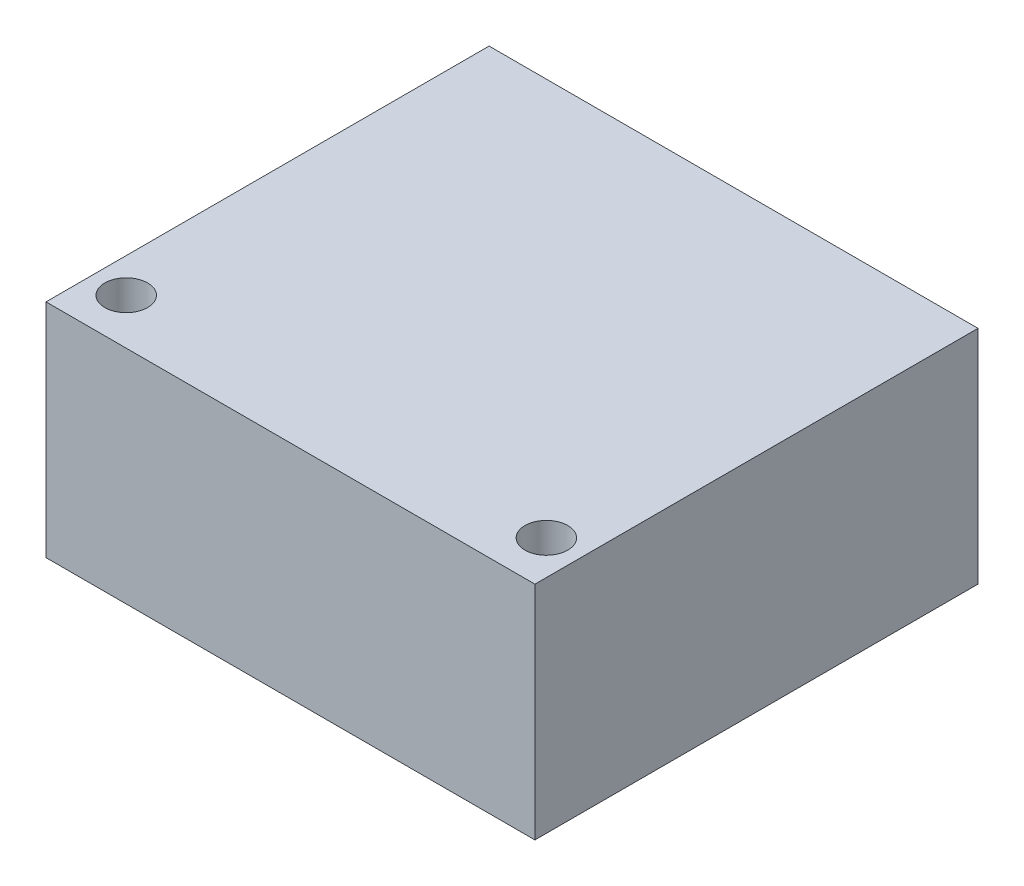
ISO-10303-21;
HEADER;
FILE_DESCRIPTION(('STEP AP214'),'2;1');
FILE_NAME('part.step','',(''),(''),'','','');
FILE_SCHEMA(('AUTOMOTIVE_DESIGN { 1 0 10303 214 1 1 1 1 }'));
ENDSEC;
DATA;
#1=APPLICATION_CONTEXT('core data for automotive mechanical design processes');
#2=APPLICATION_PROTOCOL_DEFINITION('international standard','automotive_design',2000,#1);
#3=PRODUCT_CONTEXT('',#1,'mechanical');
#4=PRODUCT('Part','Part','',(#3));
#5=PRODUCT_RELATED_PRODUCT_CATEGORY('part','',(#4));
#6=PRODUCT_DEFINITION_FORMATION('','',#4);
#7=PRODUCT_DEFINITION_CONTEXT('part definition',#1,'design');
#8=PRODUCT_DEFINITION('design','',#6,#7);
#9=PRODUCT_DEFINITION_SHAPE('','',#8);
#10=(LENGTH_UNIT() NAMED_UNIT(*) SI_UNIT(.MILLI.,.METRE.));
#11=(NAMED_UNIT(*) PLANE_ANGLE_UNIT() SI_UNIT($,.RADIAN.));
#12=(NAMED_UNIT(*) SI_UNIT($,.STERADIAN.) SOLID_ANGLE_UNIT());
#13=UNCERTAINTY_MEASURE_WITH_UNIT(LENGTH_MEASURE(1.E-05),#10,'distance_accuracy_value','');
#14=(GEOMETRIC_REPRESENTATION_CONTEXT(3) GLOBAL_UNCERTAINTY_ASSIGNED_CONTEXT((#13)) GLOBAL_UNIT_ASSIGNED_CONTEXT((#10,
#11,#12)) REPRESENTATION_CONTEXT('',''));
#15=CARTESIAN_POINT('',(0.,0.,0.));
#16=DIRECTION('',(0.,0.,1.));
#17=DIRECTION('',(1.,0.,0.));
#18=AXIS2_PLACEMENT_3D('',#15,#16,#17);
#19=CARTESIAN_POINT('',(16.,14.5,-14.5));
#20=DIRECTION('',(-1.,0.,0.));
#21=DIRECTION('',(0.,0.,1.));
#22=AXIS2_PLACEMENT_3D('',#19,#20,#21);
#23=PLANE('',#22);
#24=DIRECTION('',(0.,0.,-1.));
#25=VECTOR('',#24,1.);
#26=CARTESIAN_POINT('',(16.,0.,-14.5));
#27=LINE('',#26,#25);
#28=CARTESIAN_POINT('',(16.,0.,14.5));
#29=VERTEX_POINT('',#28);
#30=CARTESIAN_POINT('',(16.,0.,-14.5));
#31=VERTEX_POINT('',#30);
#32=EDGE_CURVE('E106',#29,#31,#27,.T.);
#33=ORIENTED_EDGE('',*,*,#32,.T.);
#34=DIRECTION('',(0.,-1.,0.));
#35=VECTOR('',#34,1.);
#36=CARTESIAN_POINT('',(16.,14.5,-14.5));
#37=LINE('',#36,#35);
#38=CARTESIAN_POINT('',(16.,14.5,-14.5));
#39=VERTEX_POINT('',#38);
#40=EDGE_CURVE('E11',#39,#31,#37,.T.);
#41=ORIENTED_EDGE('',*,*,#40,.F.);
#42=DIRECTION('',(0.,0.,-1.));
#43=VECTOR('',#42,1.);
#44=CARTESIAN_POINT('',(16.,14.5,-14.5));
#45=LINE('',#44,#43);
#46=CARTESIAN_POINT('',(16.,14.5,14.5));
#47=VERTEX_POINT('',#46);
#48=EDGE_CURVE('E90',#47,#39,#45,.T.);
#49=ORIENTED_EDGE('',*,*,#48,.F.);
#50=DIRECTION('',(0.,-1.,0.));
#51=VECTOR('',#50,1.);
#52=CARTESIAN_POINT('',(16.,14.5,14.5));
#53=LINE('',#52,#51);
#54=EDGE_CURVE('E102',#47,#29,#53,.T.);
#55=ORIENTED_EDGE('',*,*,#54,.T.);
#56=EDGE_LOOP('',(#33,#41,#49,#55));
#57=FACE_BOUND('',#56,.T.);
#58=ADVANCED_FACE('F38',(#57),#23,.F.);
#59=CARTESIAN_POINT('',(-16.,14.5,-14.5));
#60=DIRECTION('',(0.,0.,1.));
#61=DIRECTION('',(1.,0.,0.));
#62=AXIS2_PLACEMENT_3D('',#59,#60,#61);
#63=PLANE('',#62);
#64=DIRECTION('',(-1.,0.,0.));
#65=VECTOR('',#64,1.);
#66=CARTESIAN_POINT('',(-16.,0.,-14.5));
#67=LINE('',#66,#65);
#68=CARTESIAN_POINT('',(-16.,0.,-14.5));
#69=VERTEX_POINT('',#68);
#70=EDGE_CURVE('E95',#31,#69,#67,.T.);
#71=ORIENTED_EDGE('',*,*,#70,.T.);
#72=DIRECTION('',(0.,-1.,0.));
#73=VECTOR('',#72,1.);
#74=CARTESIAN_POINT('',(-16.,14.5,-14.5));
#75=LINE('',#74,#73);
#76=CARTESIAN_POINT('',(-16.,14.5,-14.5));
#77=VERTEX_POINT('',#76);
#78=EDGE_CURVE('E47',#77,#69,#75,.T.);
#79=ORIENTED_EDGE('',*,*,#78,.F.);
#80=DIRECTION('',(-1.,0.,0.));
#81=VECTOR('',#80,1.);
#82=CARTESIAN_POINT('',(-16.,14.5,-14.5));
#83=LINE('',#82,#81);
#84=EDGE_CURVE('E85',#39,#77,#83,.T.);
#85=ORIENTED_EDGE('',*,*,#84,.F.);
#86=ORIENTED_EDGE('',*,*,#40,.T.);
#87=EDGE_LOOP('',(#71,#79,#85,#86));
#88=FACE_BOUND('',#87,.T.);
#89=ADVANCED_FACE('F94',(#88),#63,.F.);
#90=CARTESIAN_POINT('',(-16.,14.5,-14.5));
#91=DIRECTION('',(1.,0.,0.));
#92=DIRECTION('',(0.,0.,-1.));
#93=AXIS2_PLACEMENT_3D('',#90,#91,#92);
#94=PLANE('',#93);
#95=DIRECTION('',(0.,0.,1.));
#96=VECTOR('',#95,1.);
#97=CARTESIAN_POINT('',(-16.,0.,-14.5));
#98=LINE('',#97,#96);
#99=CARTESIAN_POINT('',(-16.,0.,14.5));
#100=VERTEX_POINT('',#99);
#101=EDGE_CURVE('E72',#69,#100,#98,.T.);
#102=ORIENTED_EDGE('',*,*,#101,.T.);
#103=DIRECTION('',(0.,-1.,0.));
#104=VECTOR('',#103,1.);
#105=CARTESIAN_POINT('',(-16.,14.5,14.5));
#106=LINE('',#105,#104);
#107=CARTESIAN_POINT('',(-16.,14.5,14.5));
#108=VERTEX_POINT('',#107);
#109=EDGE_CURVE('E97',#108,#100,#106,.T.);
#110=ORIENTED_EDGE('',*,*,#109,.F.);
#111=DIRECTION('',(0.,0.,1.));
#112=VECTOR('',#111,1.);
#113=CARTESIAN_POINT('',(-16.,14.5,-14.5));
#114=LINE('',#113,#112);
#115=EDGE_CURVE('E88',#77,#108,#114,.T.);
#116=ORIENTED_EDGE('',*,*,#115,.F.);
#117=ORIENTED_EDGE('',*,*,#78,.T.);
#118=EDGE_LOOP('',(#102,#110,#116,#117));
#119=FACE_BOUND('',#118,.T.);
#120=ADVANCED_FACE('F98',(#119),#94,.F.);
#121=CARTESIAN_POINT('',(-16.,14.5,14.5));
#122=DIRECTION('',(0.,0.,-1.));
#123=DIRECTION('',(-1.,0.,0.));
#124=AXIS2_PLACEMENT_3D('',#121,#122,#123);
#125=PLANE('',#124);
#126=DIRECTION('',(1.,0.,0.));
#127=VECTOR('',#126,1.);
#128=CARTESIAN_POINT('',(-16.,0.,14.5));
#129=LINE('',#128,#127);
#130=EDGE_CURVE('E78',#100,#29,#129,.T.);
#131=ORIENTED_EDGE('',*,*,#130,.T.);
#132=ORIENTED_EDGE('',*,*,#54,.F.);
#133=DIRECTION('',(1.,0.,0.));
#134=VECTOR('',#133,1.);
#135=CARTESIAN_POINT('',(-16.,14.5,14.5));
#136=LINE('',#135,#134);
#137=EDGE_CURVE('E55',#108,#47,#136,.T.);
#138=ORIENTED_EDGE('',*,*,#137,.F.);
#139=ORIENTED_EDGE('',*,*,#109,.T.);
#140=EDGE_LOOP('',(#131,#132,#138,#139));
#141=FACE_BOUND('',#140,.T.);
#142=ADVANCED_FACE('F120',(#141),#125,.F.);
#143=CARTESIAN_POINT('',(0.,14.5,0.));
#144=DIRECTION('',(0.,1.,0.));
#145=DIRECTION('',(0.,0.,1.));
#146=AXIS2_PLACEMENT_3D('',#143,#144,#145);
#147=PLANE('',#146);
#148=CARTESIAN_POINT('',(-13.75,14.5,11.5));
#149=DIRECTION('',(0.,1.,0.));
#150=DIRECTION('',(0.,0.,1.));
#151=AXIS2_PLACEMENT_3D('',#148,#149,#150);
#152=CIRCLE('',#151,1.4);
#153=CARTESIAN_POINT('',(-13.75,14.5,12.9));
#154=VERTEX_POINT('',#153);
#155=EDGE_CURVE('E135',#154,#154,#152,.T.);
#156=ORIENTED_EDGE('',*,*,#155,.F.);
#157=EDGE_LOOP('',(#156));
#158=FACE_BOUND('',#157,.T.);
#159=CARTESIAN_POINT('',(13.75,14.5,11.5));
#160=DIRECTION('',(0.,1.,0.));
#161=DIRECTION('',(0.,0.,1.));
#162=AXIS2_PLACEMENT_3D('',#159,#160,#161);
#163=CIRCLE('',#162,1.4);
#164=CARTESIAN_POINT('',(13.75,14.5,12.9));
#165=VERTEX_POINT('',#164);
#166=EDGE_CURVE('E127',#165,#165,#163,.T.);
#167=ORIENTED_EDGE('',*,*,#166,.F.);
#168=EDGE_LOOP('',(#167));
#169=FACE_BOUND('',#168,.T.);
#170=ORIENTED_EDGE('',*,*,#48,.T.);
#171=ORIENTED_EDGE('',*,*,#84,.T.);
#172=ORIENTED_EDGE('',*,*,#115,.T.);
#173=ORIENTED_EDGE('',*,*,#137,.T.);
#174=EDGE_LOOP('',(#170,#171,#172,#173));
#175=FACE_BOUND('',#174,.T.);
#176=ADVANCED_FACE('F86',(#158,#169,#175),#147,.T.);
#177=CARTESIAN_POINT('',(0.,0.,0.));
#178=DIRECTION('',(0.,1.,0.));
#179=DIRECTION('',(0.,0.,1.));
#180=AXIS2_PLACEMENT_3D('',#177,#178,#179);
#181=PLANE('',#180);
#182=CARTESIAN_POINT('',(-13.75,0.,11.5));
#183=DIRECTION('',(0.,1.,0.));
#184=DIRECTION('',(0.,0.,1.));
#185=AXIS2_PLACEMENT_3D('',#182,#183,#184);
#186=CIRCLE('',#185,1.4);
#187=CARTESIAN_POINT('',(-13.75,0.,12.9));
#188=VERTEX_POINT('',#187);
#189=EDGE_CURVE('E110',#188,#188,#186,.T.);
#190=ORIENTED_EDGE('',*,*,#189,.T.);
#191=EDGE_LOOP('',(#190));
#192=FACE_BOUND('',#191,.T.);
#193=CARTESIAN_POINT('',(13.75,0.,11.5));
#194=DIRECTION('',(0.,1.,0.));
#195=DIRECTION('',(0.,0.,1.));
#196=AXIS2_PLACEMENT_3D('',#193,#194,#195);
#197=CIRCLE('',#196,1.4);
#198=CARTESIAN_POINT('',(13.75,0.,12.9));
#199=VERTEX_POINT('',#198);
#200=EDGE_CURVE('E131',#199,#199,#197,.T.);
#201=ORIENTED_EDGE('',*,*,#200,.T.);
#202=EDGE_LOOP('',(#201));
#203=FACE_BOUND('',#202,.T.);
#204=ORIENTED_EDGE('',*,*,#32,.F.);
#205=ORIENTED_EDGE('',*,*,#130,.F.);
#206=ORIENTED_EDGE('',*,*,#101,.F.);
#207=ORIENTED_EDGE('',*,*,#70,.F.);
#208=EDGE_LOOP('',(#204,#205,#206,#207));
#209=FACE_BOUND('',#208,.T.);
#210=ADVANCED_FACE('F123',(#192,#203,#209),#181,.F.);
#211=CARTESIAN_POINT('',(13.75,0.,11.5));
#212=DIRECTION('',(0.,1.,0.));
#213=DIRECTION('',(0.,0.,1.));
#214=AXIS2_PLACEMENT_3D('',#211,#212,#213);
#215=CYLINDRICAL_SURFACE('',#214,1.4);
#216=ORIENTED_EDGE('',*,*,#200,.F.);
#217=EDGE_LOOP('',(#216));
#218=FACE_BOUND('',#217,.T.);
#219=ORIENTED_EDGE('',*,*,#166,.T.);
#220=EDGE_LOOP('',(#219));
#221=FACE_BOUND('',#220,.T.);
#222=ADVANCED_FACE('F148',(#218,#221),#215,.F.);
#223=CARTESIAN_POINT('',(-13.75,0.,11.5));
#224=DIRECTION('',(0.,1.,0.));
#225=DIRECTION('',(0.,0.,1.));
#226=AXIS2_PLACEMENT_3D('',#223,#224,#225);
#227=CYLINDRICAL_SURFACE('',#226,1.4);
#228=ORIENTED_EDGE('',*,*,#189,.F.);
#229=EDGE_LOOP('',(#228));
#230=FACE_BOUND('',#229,.T.);
#231=ORIENTED_EDGE('',*,*,#155,.T.);
#232=EDGE_LOOP('',(#231));
#233=FACE_BOUND('',#232,.T.);
#234=ADVANCED_FACE('F145',(#230,#233),#227,.F.);
#235=CLOSED_SHELL('',(#58,#89,#120,#142,#176,#210,#222,#234));
#236=MANIFOLD_SOLID_BREP('B2',#235);
#237=ADVANCED_BREP_SHAPE_REPRESENTATION('',(#18,#236),#14);
#238=SHAPE_DEFINITION_REPRESENTATION(#9,#237);
ENDSEC;
END-ISO-10303-21;
